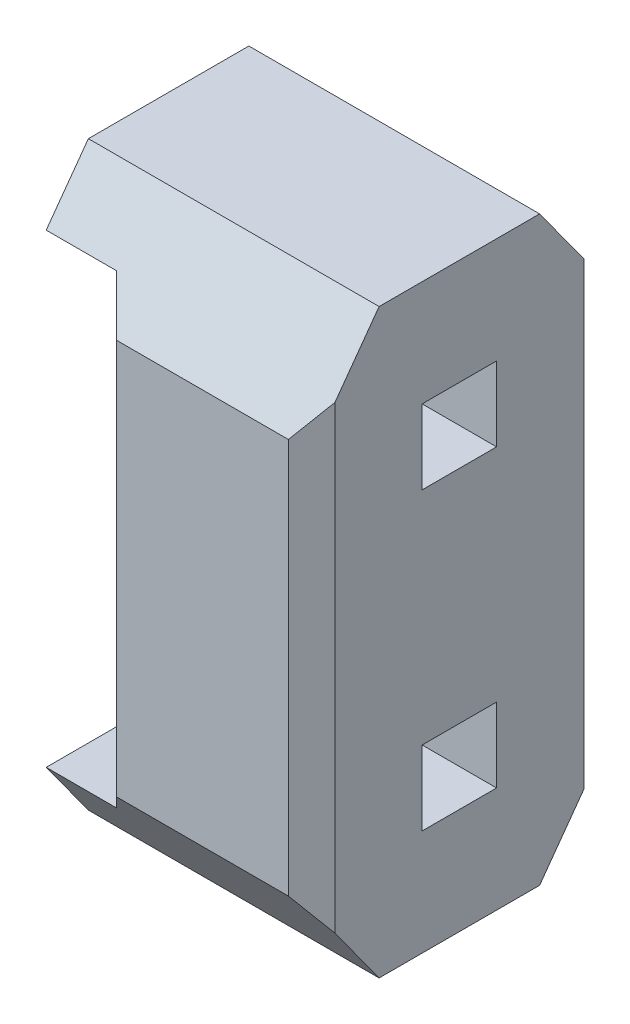
ISO-10303-21;
HEADER;
FILE_DESCRIPTION(('STEP AP214'),'2;1');
FILE_NAME('part.step','',(''),(''),'','','');
FILE_SCHEMA(('AUTOMOTIVE_DESIGN { 1 0 10303 214 1 1 1 1 }'));
ENDSEC;
DATA;
#1=APPLICATION_CONTEXT('core data for automotive mechanical design processes');
#2=APPLICATION_PROTOCOL_DEFINITION('international standard','automotive_design',2000,#1);
#3=PRODUCT_CONTEXT('',#1,'mechanical');
#4=PRODUCT('Part','Part','',(#3));
#5=PRODUCT_RELATED_PRODUCT_CATEGORY('part','',(#4));
#6=PRODUCT_DEFINITION_FORMATION('','',#4);
#7=PRODUCT_DEFINITION_CONTEXT('part definition',#1,'design');
#8=PRODUCT_DEFINITION('design','',#6,#7);
#9=PRODUCT_DEFINITION_SHAPE('','',#8);
#10=(LENGTH_UNIT() NAMED_UNIT(*) SI_UNIT(.MILLI.,.METRE.));
#11=(NAMED_UNIT(*) PLANE_ANGLE_UNIT() SI_UNIT($,.RADIAN.));
#12=(NAMED_UNIT(*) SI_UNIT($,.STERADIAN.) SOLID_ANGLE_UNIT());
#13=UNCERTAINTY_MEASURE_WITH_UNIT(LENGTH_MEASURE(1.E-05),#10,'distance_accuracy_value','');
#14=(GEOMETRIC_REPRESENTATION_CONTEXT(3) GLOBAL_UNCERTAINTY_ASSIGNED_CONTEXT((#13)) GLOBAL_UNIT_ASSIGNED_CONTEXT((#10,
#11,#12)) REPRESENTATION_CONTEXT('',''));
#15=CARTESIAN_POINT('',(0.,0.,0.));
#16=DIRECTION('',(0.,0.,1.));
#17=DIRECTION('',(1.,0.,0.));
#18=AXIS2_PLACEMENT_3D('',#15,#16,#17);
#19=CARTESIAN_POINT('',(1.25,4.6,-25.69));
#20=DIRECTION('',(0.,0.586967571460905,0.809610443394407));
#21=DIRECTION('',(0.,-0.809610443394407,0.586967571460905));
#22=AXIS2_PLACEMENT_3D('',#19,#20,#21);
#23=PLANE('',#22);
#24=DIRECTION('',(1.,0.,0.));
#25=VECTOR('',#24,1.);
#26=CARTESIAN_POINT('',(1.25,4.5,-25.6175));
#27=LINE('',#26,#25);
#28=CARTESIAN_POINT('',(0.,4.5,-25.6175));
#29=VERTEX_POINT('',#28);
#30=CARTESIAN_POINT('',(0.602500000000325,4.5,-25.6175000000001));
#31=VERTEX_POINT('',#30);
#32=EDGE_CURVE('E199',#29,#31,#27,.T.);
#33=ORIENTED_EDGE('',*,*,#32,.T.);
#34=DIRECTION('',(0.506207656348693,-0.698217457033984,0.506207656349605));
#35=VECTOR('',#34,1.);
#36=CARTESIAN_POINT('',(0.6025000000002,4.5,-25.6175));
#37=LINE('',#36,#35);
#38=CARTESIAN_POINT('',(0.819999999999672,4.2,-25.3999999999999));
#39=VERTEX_POINT('',#38);
#40=EDGE_CURVE('E197',#31,#39,#37,.T.);
#41=ORIENTED_EDGE('',*,*,#40,.T.);
#42=DIRECTION('',(1.,0.,0.));
#43=VECTOR('',#42,1.);
#44=CARTESIAN_POINT('',(1.25,4.19999999999999,-25.4));
#45=LINE('',#44,#43);
#46=CARTESIAN_POINT('',(2.30000000000012,4.2,-25.3999999999999));
#47=VERTEX_POINT('',#46);
#48=EDGE_CURVE('E20',#39,#47,#45,.T.);
#49=ORIENTED_EDGE('',*,*,#48,.T.);
#50=DIRECTION('',(0.506207656348955,0.69821745703386,-0.506207656349514));
#51=VECTOR('',#50,1.);
#52=CARTESIAN_POINT('',(2.3,4.19999999999999,-25.4));
#53=LINE('',#52,#51);
#54=CARTESIAN_POINT('',(2.49999999999988,4.47586206896591,-25.6000000000002));
#55=VERTEX_POINT('',#54);
#56=EDGE_CURVE('E181',#47,#55,#53,.T.);
#57=ORIENTED_EDGE('',*,*,#56,.T.);
#58=DIRECTION('',(0.,-0.809610443394407,0.586967571460905));
#59=VECTOR('',#58,1.);
#60=CARTESIAN_POINT('',(2.5,4.6,-25.69));
#61=LINE('',#60,#59);
#62=CARTESIAN_POINT('',(2.5,5.,-25.98));
#63=VERTEX_POINT('',#62);
#64=EDGE_CURVE('E188',#55,#63,#61,.F.);
#65=ORIENTED_EDGE('',*,*,#64,.T.);
#66=DIRECTION('',(1.,0.,0.));
#67=VECTOR('',#66,1.);
#68=CARTESIAN_POINT('',(1.25,5.,-25.98));
#69=LINE('',#68,#67);
#70=CARTESIAN_POINT('',(0.,5.,-25.98));
#71=VERTEX_POINT('',#70);
#72=EDGE_CURVE('E215',#71,#63,#69,.T.);
#73=ORIENTED_EDGE('',*,*,#72,.F.);
#74=DIRECTION('',(0.,-0.809610443394407,0.586967571460905));
#75=VECTOR('',#74,1.);
#76=CARTESIAN_POINT('',(0.,4.6,-25.69));
#77=LINE('',#76,#75);
#78=EDGE_CURVE('E207',#71,#29,#77,.T.);
#79=ORIENTED_EDGE('',*,*,#78,.T.);
#80=EDGE_LOOP('',(#33,#41,#49,#57,#65,#73,#79));
#81=FACE_BOUND('',#80,.T.);
#82=ADVANCED_FACE('F17',(#81),#23,.T.);
#83=CARTESIAN_POINT('',(1.25,4.6,-27.65));
#84=DIRECTION('',(0.,-0.586967571460905,0.809610443394407));
#85=DIRECTION('',(0.,-0.809610443394407,-0.586967571460905));
#86=AXIS2_PLACEMENT_3D('',#83,#84,#85);
#87=PLANE('',#86);
#88=DIRECTION('',(0.,-0.809610443394407,-0.586967571460905));
#89=VECTOR('',#88,1.);
#90=CARTESIAN_POINT('',(0.,4.6,-27.65));
#91=LINE('',#90,#89);
#92=CARTESIAN_POINT('',(0.,5.,-27.36));
#93=VERTEX_POINT('',#92);
#94=CARTESIAN_POINT('',(0.,4.5,-27.7225));
#95=VERTEX_POINT('',#94);
#96=EDGE_CURVE('E263',#93,#95,#91,.T.);
#97=ORIENTED_EDGE('',*,*,#96,.F.);
#98=DIRECTION('',(1.,0.,0.));
#99=VECTOR('',#98,1.);
#100=CARTESIAN_POINT('',(1.25,5.,-27.36));
#101=LINE('',#100,#99);
#102=CARTESIAN_POINT('',(2.5,5.,-27.36));
#103=VERTEX_POINT('',#102);
#104=EDGE_CURVE('E227',#103,#93,#101,.F.);
#105=ORIENTED_EDGE('',*,*,#104,.F.);
#106=DIRECTION('',(0.,-0.809610443394407,-0.586967571460905));
#107=VECTOR('',#106,1.);
#108=CARTESIAN_POINT('',(2.5,4.6,-27.65));
#109=LINE('',#108,#107);
#110=CARTESIAN_POINT('',(2.49999999999988,4.47586206896591,-27.7399999999998));
#111=VERTEX_POINT('',#110);
#112=EDGE_CURVE('E223',#111,#103,#109,.F.);
#113=ORIENTED_EDGE('',*,*,#112,.F.);
#114=DIRECTION('',(0.506207656348954,0.698217457033861,0.506207656349513));
#115=VECTOR('',#114,1.);
#116=CARTESIAN_POINT('',(2.3,4.19999999999999,-27.94));
#117=LINE('',#116,#115);
#118=CARTESIAN_POINT('',(2.30000000000012,4.19999999999999,-27.9400000000001));
#119=VERTEX_POINT('',#118);
#120=EDGE_CURVE('E266',#119,#111,#117,.T.);
#121=ORIENTED_EDGE('',*,*,#120,.F.);
#122=DIRECTION('',(1.,0.,0.));
#123=VECTOR('',#122,1.);
#124=CARTESIAN_POINT('',(1.25,4.19999999999999,-27.94));
#125=LINE('',#124,#123);
#126=CARTESIAN_POINT('',(0.819999999999672,4.19999999999999,-27.9400000000001));
#127=VERTEX_POINT('',#126);
#128=EDGE_CURVE('E205',#127,#119,#125,.T.);
#129=ORIENTED_EDGE('',*,*,#128,.F.);
#130=DIRECTION('',(0.506207656348693,-0.698217457033984,-0.506207656349605));
#131=VECTOR('',#130,1.);
#132=CARTESIAN_POINT('',(0.6025000000002,4.5,-27.7225));
#133=LINE('',#132,#131);
#134=CARTESIAN_POINT('',(0.602500000000325,4.5,-27.7224999999999));
#135=VERTEX_POINT('',#134);
#136=EDGE_CURVE('E203',#135,#127,#133,.T.);
#137=ORIENTED_EDGE('',*,*,#136,.F.);
#138=DIRECTION('',(1.,0.,0.));
#139=VECTOR('',#138,1.);
#140=CARTESIAN_POINT('',(1.25,4.5,-27.7225));
#141=LINE('',#140,#139);
#142=EDGE_CURVE('E261',#95,#135,#141,.T.);
#143=ORIENTED_EDGE('',*,*,#142,.F.);
#144=EDGE_LOOP('',(#97,#105,#113,#121,#129,#137,#143));
#145=FACE_BOUND('',#144,.T.);
#146=ADVANCED_FACE('F285',(#145),#87,.F.);
#147=CARTESIAN_POINT('',(1.25,0.4,-27.65));
#148=DIRECTION('',(0.,0.586967571460905,0.809610443394407));
#149=DIRECTION('',(0.,-0.809610443394407,0.586967571460905));
#150=AXIS2_PLACEMENT_3D('',#147,#148,#149);
#151=PLANE('',#150);
#152=DIRECTION('',(-0.506207656349399,0.698217457033649,-0.506207656349361));
#153=VECTOR('',#152,1.);
#154=CARTESIAN_POINT('',(2.5,0.524137931034496,-27.74));
#155=LINE('',#154,#153);
#156=CARTESIAN_POINT('',(2.49999999999988,0.524137931034498,-27.7399999999999));
#157=VERTEX_POINT('',#156);
#158=CARTESIAN_POINT('',(2.30000000000012,0.800000000000006,-27.9400000000001));
#159=VERTEX_POINT('',#158);
#160=EDGE_CURVE('E251',#157,#159,#155,.T.);
#161=ORIENTED_EDGE('',*,*,#160,.F.);
#162=DIRECTION('',(0.,-0.809610443394407,0.586967571460905));
#163=VECTOR('',#162,1.);
#164=CARTESIAN_POINT('',(2.5,0.4,-27.65));
#165=LINE('',#164,#163);
#166=CARTESIAN_POINT('',(2.5,0.,-27.36));
#167=VERTEX_POINT('',#166);
#168=EDGE_CURVE('E253',#167,#157,#165,.F.);
#169=ORIENTED_EDGE('',*,*,#168,.F.);
#170=DIRECTION('',(1.,0.,0.));
#171=VECTOR('',#170,1.);
#172=CARTESIAN_POINT('',(1.25,0.,-27.36));
#173=LINE('',#172,#171);
#174=CARTESIAN_POINT('',(0.,0.,-27.36));
#175=VERTEX_POINT('',#174);
#176=EDGE_CURVE('E288',#167,#175,#173,.F.);
#177=ORIENTED_EDGE('',*,*,#176,.T.);
#178=DIRECTION('',(0.,-0.809610443394407,0.586967571460905));
#179=VECTOR('',#178,1.);
#180=CARTESIAN_POINT('',(0.,0.4,-27.65));
#181=LINE('',#180,#179);
#182=CARTESIAN_POINT('',(0.,0.500000000000001,-27.7225));
#183=VERTEX_POINT('',#182);
#184=EDGE_CURVE('E255',#183,#175,#181,.T.);
#185=ORIENTED_EDGE('',*,*,#184,.F.);
#186=DIRECTION('',(1.,0.,0.));
#187=VECTOR('',#186,1.);
#188=CARTESIAN_POINT('',(1.25,0.500000000000003,-27.7225));
#189=LINE('',#188,#187);
#190=CARTESIAN_POINT('',(0.602500000000325,0.500000000000002,-27.7224999999999));
#191=VERTEX_POINT('',#190);
#192=EDGE_CURVE('E257',#191,#183,#189,.F.);
#193=ORIENTED_EDGE('',*,*,#192,.F.);
#194=DIRECTION('',(-0.506207656348693,-0.698217457033984,0.506207656349605));
#195=VECTOR('',#194,1.);
#196=CARTESIAN_POINT('',(0.8199999999998,0.800000000000012,-27.94));
#197=LINE('',#196,#195);
#198=CARTESIAN_POINT('',(0.819999999999672,0.800000000000006,-27.9400000000001));
#199=VERTEX_POINT('',#198);
#200=EDGE_CURVE('E259',#199,#191,#197,.T.);
#201=ORIENTED_EDGE('',*,*,#200,.F.);
#202=DIRECTION('',(1.,0.,0.));
#203=VECTOR('',#202,1.);
#204=CARTESIAN_POINT('',(1.25,0.800000000000012,-27.94));
#205=LINE('',#204,#203);
#206=EDGE_CURVE('E249',#159,#199,#205,.F.);
#207=ORIENTED_EDGE('',*,*,#206,.F.);
#208=EDGE_LOOP('',(#161,#169,#177,#185,#193,#201,#207));
#209=FACE_BOUND('',#208,.T.);
#210=ADVANCED_FACE('F431',(#209),#151,.F.);
#211=CARTESIAN_POINT('',(1.25,0.4,-25.69));
#212=DIRECTION('',(0.,-0.586967571460905,0.809610443394407));
#213=DIRECTION('',(0.,-0.809610443394407,-0.586967571460905));
#214=AXIS2_PLACEMENT_3D('',#211,#212,#213);
#215=PLANE('',#214);
#216=DIRECTION('',(1.,0.,0.));
#217=VECTOR('',#216,1.);
#218=CARTESIAN_POINT('',(1.25,0.800000000000011,-25.4));
#219=LINE('',#218,#217);
#220=CARTESIAN_POINT('',(2.30000000000012,0.800000000000005,-25.3999999999999));
#221=VERTEX_POINT('',#220);
#222=CARTESIAN_POINT('',(0.819999999999672,0.800000000000005,-25.3999999999999));
#223=VERTEX_POINT('',#222);
#224=EDGE_CURVE('E191',#221,#223,#219,.F.);
#225=ORIENTED_EDGE('',*,*,#224,.T.);
#226=DIRECTION('',(-0.506207656348693,-0.698217457033984,-0.506207656349605));
#227=VECTOR('',#226,1.);
#228=CARTESIAN_POINT('',(0.8199999999998,0.800000000000011,-25.4));
#229=LINE('',#228,#227);
#230=CARTESIAN_POINT('',(0.602500000000325,0.500000000000001,-25.6175000000001));
#231=VERTEX_POINT('',#230);
#232=EDGE_CURVE('E232',#223,#231,#229,.T.);
#233=ORIENTED_EDGE('',*,*,#232,.T.);
#234=DIRECTION('',(1.,0.,0.));
#235=VECTOR('',#234,1.);
#236=CARTESIAN_POINT('',(1.25,0.500000000000002,-25.6175));
#237=LINE('',#236,#235);
#238=CARTESIAN_POINT('',(0.,0.500000000000001,-25.6175));
#239=VERTEX_POINT('',#238);
#240=EDGE_CURVE('E246',#231,#239,#237,.F.);
#241=ORIENTED_EDGE('',*,*,#240,.T.);
#242=DIRECTION('',(0.,-0.809610443394407,-0.586967571460905));
#243=VECTOR('',#242,1.);
#244=CARTESIAN_POINT('',(0.,0.4,-25.69));
#245=LINE('',#244,#243);
#246=CARTESIAN_POINT('',(0.,0.,-25.98));
#247=VERTEX_POINT('',#246);
#248=EDGE_CURVE('E244',#239,#247,#245,.T.);
#249=ORIENTED_EDGE('',*,*,#248,.T.);
#250=DIRECTION('',(1.,0.,0.));
#251=VECTOR('',#250,1.);
#252=CARTESIAN_POINT('',(1.25,0.,-25.98));
#253=LINE('',#252,#251);
#254=CARTESIAN_POINT('',(2.5,0.,-25.98));
#255=VERTEX_POINT('',#254);
#256=EDGE_CURVE('E293',#247,#255,#253,.T.);
#257=ORIENTED_EDGE('',*,*,#256,.T.);
#258=DIRECTION('',(0.,-0.809610443394407,-0.586967571460905));
#259=VECTOR('',#258,1.);
#260=CARTESIAN_POINT('',(2.5,0.4,-25.69));
#261=LINE('',#260,#259);
#262=CARTESIAN_POINT('',(2.49999999999988,0.524137931034498,-25.6000000000001));
#263=VERTEX_POINT('',#262);
#264=EDGE_CURVE('E241',#255,#263,#261,.F.);
#265=ORIENTED_EDGE('',*,*,#264,.T.);
#266=DIRECTION('',(-0.5062076563494,0.698217457033648,0.506207656349362));
#267=VECTOR('',#266,1.);
#268=CARTESIAN_POINT('',(2.5,0.524137931034496,-25.6));
#269=LINE('',#268,#267);
#270=EDGE_CURVE('E239',#263,#221,#269,.T.);
#271=ORIENTED_EDGE('',*,*,#270,.T.);
#272=EDGE_LOOP('',(#225,#233,#241,#249,#257,#265,#271));
#273=FACE_BOUND('',#272,.T.);
#274=ADVANCED_FACE('F421',(#273),#215,.T.);
#275=CARTESIAN_POINT('',(1.25,5.,-26.67));
#276=DIRECTION('',(0.,1.,0.));
#277=DIRECTION('',(0.,0.,1.));
#278=AXIS2_PLACEMENT_3D('',#275,#276,#277);
#279=PLANE('',#278);
#280=ORIENTED_EDGE('',*,*,#104,.T.);
#281=DIRECTION('',(0.,0.,-1.));
#282=VECTOR('',#281,1.);
#283=CARTESIAN_POINT('',(0.,5.,-26.67));
#284=LINE('',#283,#282);
#285=EDGE_CURVE('E231',#93,#71,#284,.F.);
#286=ORIENTED_EDGE('',*,*,#285,.T.);
#287=ORIENTED_EDGE('',*,*,#72,.T.);
#288=DIRECTION('',(0.,0.,1.));
#289=VECTOR('',#288,1.);
#290=CARTESIAN_POINT('',(2.5,5.,-26.67));
#291=LINE('',#290,#289);
#292=EDGE_CURVE('E219',#63,#103,#291,.F.);
#293=ORIENTED_EDGE('',*,*,#292,.T.);
#294=EDGE_LOOP('',(#280,#286,#287,#293));
#295=FACE_BOUND('',#294,.T.);
#296=ADVANCED_FACE('F229',(#295),#279,.T.);
#297=CARTESIAN_POINT('',(1.25,0.,-26.67));
#298=DIRECTION('',(0.,1.,0.));
#299=DIRECTION('',(0.,0.,1.));
#300=AXIS2_PLACEMENT_3D('',#297,#298,#299);
#301=PLANE('',#300);
#302=DIRECTION('',(0.,0.,-1.));
#303=VECTOR('',#302,1.);
#304=CARTESIAN_POINT('',(0.,0.,-26.67));
#305=LINE('',#304,#303);
#306=EDGE_CURVE('E297',#247,#175,#305,.T.);
#307=ORIENTED_EDGE('',*,*,#306,.T.);
#308=ORIENTED_EDGE('',*,*,#176,.F.);
#309=DIRECTION('',(0.,0.,1.));
#310=VECTOR('',#309,1.);
#311=CARTESIAN_POINT('',(2.5,0.,-26.67));
#312=LINE('',#311,#310);
#313=EDGE_CURVE('E287',#255,#167,#312,.F.);
#314=ORIENTED_EDGE('',*,*,#313,.F.);
#315=ORIENTED_EDGE('',*,*,#256,.F.);
#316=EDGE_LOOP('',(#307,#308,#314,#315));
#317=FACE_BOUND('',#316,.T.);
#318=ADVANCED_FACE('F428',(#317),#301,.F.);
#319=CARTESIAN_POINT('',(0.,4.75,-26.67));
#320=DIRECTION('',(1.,0.,0.));
#321=DIRECTION('',(0.,0.,-1.));
#322=AXIS2_PLACEMENT_3D('',#319,#320,#321);
#323=PLANE('',#322);
#324=ORIENTED_EDGE('',*,*,#285,.F.);
#325=ORIENTED_EDGE('',*,*,#96,.T.);
#326=DIRECTION('',(0.,0.,1.));
#327=VECTOR('',#326,1.);
#328=CARTESIAN_POINT('',(0.,4.5,-26.67));
#329=LINE('',#328,#327);
#330=EDGE_CURVE('E307',#95,#29,#329,.T.);
#331=ORIENTED_EDGE('',*,*,#330,.T.);
#332=ORIENTED_EDGE('',*,*,#78,.F.);
#333=EDGE_LOOP('',(#324,#325,#331,#332));
#334=FACE_BOUND('',#333,.T.);
#335=ADVANCED_FACE('F441',(#334),#323,.F.);
#336=CARTESIAN_POINT('',(0.,0.25,-26.67));
#337=DIRECTION('',(1.,0.,0.));
#338=DIRECTION('',(0.,0.,-1.));
#339=AXIS2_PLACEMENT_3D('',#336,#337,#338);
#340=PLANE('',#339);
#341=ORIENTED_EDGE('',*,*,#306,.F.);
#342=ORIENTED_EDGE('',*,*,#248,.F.);
#343=DIRECTION('',(0.,0.,1.));
#344=VECTOR('',#343,1.);
#345=CARTESIAN_POINT('',(0.,0.5,-26.67));
#346=LINE('',#345,#344);
#347=EDGE_CURVE('E315',#183,#239,#346,.T.);
#348=ORIENTED_EDGE('',*,*,#347,.F.);
#349=ORIENTED_EDGE('',*,*,#184,.T.);
#350=EDGE_LOOP('',(#341,#342,#348,#349));
#351=FACE_BOUND('',#350,.T.);
#352=ADVANCED_FACE('F443',(#351),#340,.F.);
#353=CARTESIAN_POINT('',(1.55,3.45,-26.67));
#354=DIRECTION('',(0.,1.,0.));
#355=DIRECTION('',(0.,0.,1.));
#356=AXIS2_PLACEMENT_3D('',#353,#354,#355);
#357=PLANE('',#356);
#358=DIRECTION('',(1.,0.,0.));
#359=VECTOR('',#358,1.);
#360=CARTESIAN_POINT('',(1.55,3.45,-26.99));
#361=LINE('',#360,#359);
#362=CARTESIAN_POINT('',(0.6,3.45,-26.99));
#363=VERTEX_POINT('',#362);
#364=CARTESIAN_POINT('',(2.5,3.45,-26.99));
#365=VERTEX_POINT('',#364);
#366=EDGE_CURVE('E332',#363,#365,#361,.T.);
#367=ORIENTED_EDGE('',*,*,#366,.F.);
#368=DIRECTION('',(0.,0.,1.));
#369=VECTOR('',#368,1.);
#370=CARTESIAN_POINT('',(0.6,3.45,-26.67));
#371=LINE('',#370,#369);
#372=CARTESIAN_POINT('',(0.6,3.45,-26.35));
#373=VERTEX_POINT('',#372);
#374=EDGE_CURVE('E302',#363,#373,#371,.T.);
#375=ORIENTED_EDGE('',*,*,#374,.T.);
#376=DIRECTION('',(1.,0.,0.));
#377=VECTOR('',#376,1.);
#378=CARTESIAN_POINT('',(1.55,3.45,-26.35));
#379=LINE('',#378,#377);
#380=CARTESIAN_POINT('',(2.5,3.45,-26.35));
#381=VERTEX_POINT('',#380);
#382=EDGE_CURVE('E327',#373,#381,#379,.T.);
#383=ORIENTED_EDGE('',*,*,#382,.T.);
#384=DIRECTION('',(0.,0.,1.));
#385=VECTOR('',#384,1.);
#386=CARTESIAN_POINT('',(2.5,3.45,-26.67));
#387=LINE('',#386,#385);
#388=EDGE_CURVE('E300',#381,#365,#387,.F.);
#389=ORIENTED_EDGE('',*,*,#388,.T.);
#390=EDGE_LOOP('',(#367,#375,#383,#389));
#391=FACE_BOUND('',#390,.T.);
#392=ADVANCED_FACE('F398',(#391),#357,.T.);
#393=CARTESIAN_POINT('',(0.71,2.5,-27.83));
#394=DIRECTION('',(0.707106781190498,0.,0.707106781182598));
#395=DIRECTION('',(0.707106781182598,0.,-0.707106781190498));
#396=AXIS2_PLACEMENT_3D('',#393,#394,#395);
#397=PLANE('',#396);
#398=ORIENTED_EDGE('',*,*,#200,.T.);
#399=DIRECTION('',(0.70710678118618,0.,-0.707106781186916));
#400=VECTOR('',#399,1.);
#401=CARTESIAN_POINT('',(0.6000000000002,0.5,-27.72));
#402=LINE('',#401,#400);
#403=CARTESIAN_POINT('',(0.600000000000407,0.5,-27.7199999999997));
#404=VERTEX_POINT('',#403);
#405=EDGE_CURVE('E312',#404,#191,#402,.T.);
#406=ORIENTED_EDGE('',*,*,#405,.F.);
#407=DIRECTION('',(0.,1.,0.));
#408=VECTOR('',#407,1.);
#409=CARTESIAN_POINT('',(0.6,2.5,-27.72));
#410=LINE('',#409,#408);
#411=CARTESIAN_POINT('',(0.600000000000407,4.5,-27.7199999999997));
#412=VERTEX_POINT('',#411);
#413=EDGE_CURVE('E337',#404,#412,#410,.T.);
#414=ORIENTED_EDGE('',*,*,#413,.T.);
#415=DIRECTION('',(0.70710678118618,0.,-0.707106781186916));
#416=VECTOR('',#415,1.);
#417=CARTESIAN_POINT('',(0.6000000000002,4.5,-27.72));
#418=LINE('',#417,#416);
#419=EDGE_CURVE('E304',#412,#135,#418,.T.);
#420=ORIENTED_EDGE('',*,*,#419,.T.);
#421=ORIENTED_EDGE('',*,*,#136,.T.);
#422=DIRECTION('',(0.,1.,0.));
#423=VECTOR('',#422,1.);
#424=CARTESIAN_POINT('',(0.8199999999998,2.5,-27.94));
#425=LINE('',#424,#423);
#426=EDGE_CURVE('E275',#127,#199,#425,.F.);
#427=ORIENTED_EDGE('',*,*,#426,.T.);
#428=EDGE_LOOP('',(#398,#406,#414,#420,#421,#427));
#429=FACE_BOUND('',#428,.T.);
#430=ADVANCED_FACE('F435',(#429),#397,.F.);
#431=CARTESIAN_POINT('',(0.30125,4.5,-26.67));
#432=DIRECTION('',(0.,1.,0.));
#433=DIRECTION('',(0.,0.,1.));
#434=AXIS2_PLACEMENT_3D('',#431,#432,#433);
#435=PLANE('',#434);
#436=ORIENTED_EDGE('',*,*,#142,.T.);
#437=ORIENTED_EDGE('',*,*,#419,.F.);
#438=DIRECTION('',(0.,0.,-1.));
#439=VECTOR('',#438,1.);
#440=CARTESIAN_POINT('',(0.6,4.5,-26.67));
#441=LINE('',#440,#439);
#442=CARTESIAN_POINT('',(0.600000000000279,4.5,-25.6200000000001));
#443=VERTEX_POINT('',#442);
#444=EDGE_CURVE('E339',#412,#443,#441,.F.);
#445=ORIENTED_EDGE('',*,*,#444,.T.);
#446=DIRECTION('',(-0.707106781182598,0.,-0.707106781190498));
#447=VECTOR('',#446,1.);
#448=CARTESIAN_POINT('',(0.71,4.5,-25.51));
#449=LINE('',#448,#447);
#450=EDGE_CURVE('E310',#443,#31,#449,.F.);
#451=ORIENTED_EDGE('',*,*,#450,.T.);
#452=ORIENTED_EDGE('',*,*,#32,.F.);
#453=ORIENTED_EDGE('',*,*,#330,.F.);
#454=EDGE_LOOP('',(#436,#437,#445,#451,#452,#453));
#455=FACE_BOUND('',#454,.T.);
#456=ADVANCED_FACE('F439',(#455),#435,.F.);
#457=CARTESIAN_POINT('',(0.71,2.5,-25.51));
#458=DIRECTION('',(0.707106781190498,0.,-0.707106781182598));
#459=DIRECTION('',(-0.707106781182598,0.,-0.707106781190498));
#460=AXIS2_PLACEMENT_3D('',#457,#458,#459);
#461=PLANE('',#460);
#462=ORIENTED_EDGE('',*,*,#232,.F.);
#463=DIRECTION('',(0.,1.,0.));
#464=VECTOR('',#463,1.);
#465=CARTESIAN_POINT('',(0.8199999999998,2.5,-25.4));
#466=LINE('',#465,#464);
#467=EDGE_CURVE('E325',#39,#223,#466,.F.);
#468=ORIENTED_EDGE('',*,*,#467,.F.);
#469=ORIENTED_EDGE('',*,*,#40,.F.);
#470=ORIENTED_EDGE('',*,*,#450,.F.);
#471=DIRECTION('',(0.,1.,0.));
#472=VECTOR('',#471,1.);
#473=CARTESIAN_POINT('',(0.6,2.5,-25.62));
#474=LINE('',#473,#472);
#475=CARTESIAN_POINT('',(0.600000000000408,0.5,-25.6200000000003));
#476=VERTEX_POINT('',#475);
#477=EDGE_CURVE('E341',#443,#476,#474,.F.);
#478=ORIENTED_EDGE('',*,*,#477,.T.);
#479=DIRECTION('',(-0.70710678118667,0.,-0.707106781186425));
#480=VECTOR('',#479,1.);
#481=CARTESIAN_POINT('',(0.6025000000002,0.5,-25.6175));
#482=LINE('',#481,#480);
#483=EDGE_CURVE('E318',#231,#476,#482,.T.);
#484=ORIENTED_EDGE('',*,*,#483,.F.);
#485=EDGE_LOOP('',(#462,#468,#469,#470,#478,#484));
#486=FACE_BOUND('',#485,.T.);
#487=ADVANCED_FACE('F416',(#486),#461,.F.);
#488=CARTESIAN_POINT('',(0.30125,0.5,-26.67));
#489=DIRECTION('',(0.,1.,0.));
#490=DIRECTION('',(0.,0.,1.));
#491=AXIS2_PLACEMENT_3D('',#488,#489,#490);
#492=PLANE('',#491);
#493=ORIENTED_EDGE('',*,*,#483,.T.);
#494=DIRECTION('',(0.,0.,-1.));
#495=VECTOR('',#494,1.);
#496=CARTESIAN_POINT('',(0.6,0.5,-26.67));
#497=LINE('',#496,#495);
#498=EDGE_CURVE('E343',#476,#404,#497,.T.);
#499=ORIENTED_EDGE('',*,*,#498,.T.);
#500=ORIENTED_EDGE('',*,*,#405,.T.);
#501=ORIENTED_EDGE('',*,*,#192,.T.);
#502=ORIENTED_EDGE('',*,*,#347,.T.);
#503=ORIENTED_EDGE('',*,*,#240,.F.);
#504=EDGE_LOOP('',(#493,#499,#500,#501,#502,#503));
#505=FACE_BOUND('',#504,.T.);
#506=ADVANCED_FACE('F418',(#505),#492,.T.);
#507=CARTESIAN_POINT('',(1.55,1.23,-26.99));
#508=DIRECTION('',(0.,0.,1.));
#509=DIRECTION('',(1.,0.,0.));
#510=AXIS2_PLACEMENT_3D('',#507,#508,#509);
#511=PLANE('',#510);
#512=DIRECTION('',(1.,0.,0.));
#513=VECTOR('',#512,1.);
#514=CARTESIAN_POINT('',(1.55,1.55,-26.99));
#515=LINE('',#514,#513);
#516=CARTESIAN_POINT('',(2.5,1.55,-26.99));
#517=VERTEX_POINT('',#516);
#518=CARTESIAN_POINT('',(0.6,1.55,-26.99));
#519=VERTEX_POINT('',#518);
#520=EDGE_CURVE('E283',#517,#519,#515,.F.);
#521=ORIENTED_EDGE('',*,*,#520,.T.);
#522=DIRECTION('',(0.,1.,0.));
#523=VECTOR('',#522,1.);
#524=CARTESIAN_POINT('',(0.6,2.5,-26.99));
#525=LINE('',#524,#523);
#526=CARTESIAN_POINT('',(0.6,0.91,-26.99));
#527=VERTEX_POINT('',#526);
#528=EDGE_CURVE('E346',#519,#527,#525,.F.);
#529=ORIENTED_EDGE('',*,*,#528,.T.);
#530=DIRECTION('',(1.,0.,0.));
#531=VECTOR('',#530,1.);
#532=CARTESIAN_POINT('',(1.55,0.91,-26.99));
#533=LINE('',#532,#531);
#534=CARTESIAN_POINT('',(2.5,0.91,-26.99));
#535=VERTEX_POINT('',#534);
#536=EDGE_CURVE('E354',#535,#527,#533,.F.);
#537=ORIENTED_EDGE('',*,*,#536,.F.);
#538=DIRECTION('',(0.,1.,0.));
#539=VECTOR('',#538,1.);
#540=CARTESIAN_POINT('',(2.5,1.23,-26.99));
#541=LINE('',#540,#539);
#542=EDGE_CURVE('E321',#535,#517,#541,.T.);
#543=ORIENTED_EDGE('',*,*,#542,.T.);
#544=EDGE_LOOP('',(#521,#529,#537,#543));
#545=FACE_BOUND('',#544,.T.);
#546=ADVANCED_FACE('F483',(#545),#511,.T.);
#547=CARTESIAN_POINT('',(1.56,2.5,-27.94));
#548=DIRECTION('',(0.,0.,1.));
#549=DIRECTION('',(1.,0.,0.));
#550=AXIS2_PLACEMENT_3D('',#547,#548,#549);
#551=PLANE('',#550);
#552=DIRECTION('',(0.,1.,0.));
#553=VECTOR('',#552,1.);
#554=CARTESIAN_POINT('',(2.30000000000047,2.5,-27.9400000000005));
#555=LINE('',#554,#553);
#556=EDGE_CURVE('E193',#159,#119,#555,.T.);
#557=ORIENTED_EDGE('',*,*,#556,.F.);
#558=ORIENTED_EDGE('',*,*,#206,.T.);
#559=ORIENTED_EDGE('',*,*,#426,.F.);
#560=ORIENTED_EDGE('',*,*,#128,.T.);
#561=EDGE_LOOP('',(#557,#558,#559,#560));
#562=FACE_BOUND('',#561,.T.);
#563=ADVANCED_FACE('F272',(#562),#551,.F.);
#564=CARTESIAN_POINT('',(1.56,2.5,-25.4));
#565=DIRECTION('',(0.,0.,1.));
#566=DIRECTION('',(1.,0.,0.));
#567=AXIS2_PLACEMENT_3D('',#564,#565,#566);
#568=PLANE('',#567);
#569=ORIENTED_EDGE('',*,*,#48,.F.);
#570=ORIENTED_EDGE('',*,*,#467,.T.);
#571=ORIENTED_EDGE('',*,*,#224,.F.);
#572=DIRECTION('',(0.,1.,0.));
#573=VECTOR('',#572,1.);
#574=CARTESIAN_POINT('',(2.30000000000047,2.5,-25.3999999999995));
#575=LINE('',#574,#573);
#576=EDGE_CURVE('E183',#47,#221,#575,.F.);
#577=ORIENTED_EDGE('',*,*,#576,.F.);
#578=EDGE_LOOP('',(#569,#570,#571,#577));
#579=FACE_BOUND('',#578,.T.);
#580=ADVANCED_FACE('F189',(#579),#568,.T.);
#581=CARTESIAN_POINT('',(1.55,3.77,-26.35));
#582=DIRECTION('',(0.,0.,1.));
#583=DIRECTION('',(1.,0.,0.));
#584=AXIS2_PLACEMENT_3D('',#581,#582,#583);
#585=PLANE('',#584);
#586=DIRECTION('',(0.,1.,0.));
#587=VECTOR('',#586,1.);
#588=CARTESIAN_POINT('',(2.5,3.77,-26.35));
#589=LINE('',#588,#587);
#590=CARTESIAN_POINT('',(2.5,4.09,-26.35));
#591=VERTEX_POINT('',#590);
#592=EDGE_CURVE('E330',#381,#591,#589,.T.);
#593=ORIENTED_EDGE('',*,*,#592,.F.);
#594=ORIENTED_EDGE('',*,*,#382,.F.);
#595=DIRECTION('',(0.,1.,0.));
#596=VECTOR('',#595,1.);
#597=CARTESIAN_POINT('',(0.6,2.5,-26.35));
#598=LINE('',#597,#596);
#599=CARTESIAN_POINT('',(0.6,4.09,-26.35));
#600=VERTEX_POINT('',#599);
#601=EDGE_CURVE('E351',#373,#600,#598,.T.);
#602=ORIENTED_EDGE('',*,*,#601,.T.);
#603=DIRECTION('',(1.,0.,0.));
#604=VECTOR('',#603,1.);
#605=CARTESIAN_POINT('',(1.55,4.09,-26.35));
#606=LINE('',#605,#604);
#607=EDGE_CURVE('E368',#600,#591,#606,.T.);
#608=ORIENTED_EDGE('',*,*,#607,.T.);
#609=EDGE_LOOP('',(#593,#594,#602,#608));
#610=FACE_BOUND('',#609,.T.);
#611=ADVANCED_FACE('F402',(#610),#585,.F.);
#612=CARTESIAN_POINT('',(1.55,3.77,-26.99));
#613=DIRECTION('',(0.,0.,1.));
#614=DIRECTION('',(1.,0.,0.));
#615=AXIS2_PLACEMENT_3D('',#612,#613,#614);
#616=PLANE('',#615);
#617=DIRECTION('',(1.,0.,0.));
#618=VECTOR('',#617,1.);
#619=CARTESIAN_POINT('',(1.55,4.09,-26.99));
#620=LINE('',#619,#618);
#621=CARTESIAN_POINT('',(2.5,4.09,-26.99));
#622=VERTEX_POINT('',#621);
#623=CARTESIAN_POINT('',(0.6,4.09,-26.99));
#624=VERTEX_POINT('',#623);
#625=EDGE_CURVE('E371',#622,#624,#620,.F.);
#626=ORIENTED_EDGE('',*,*,#625,.T.);
#627=DIRECTION('',(0.,1.,0.));
#628=VECTOR('',#627,1.);
#629=CARTESIAN_POINT('',(0.6,2.5,-26.99));
#630=LINE('',#629,#628);
#631=EDGE_CURVE('E348',#624,#363,#630,.F.);
#632=ORIENTED_EDGE('',*,*,#631,.T.);
#633=ORIENTED_EDGE('',*,*,#366,.T.);
#634=DIRECTION('',(0.,1.,0.));
#635=VECTOR('',#634,1.);
#636=CARTESIAN_POINT('',(2.5,3.77,-26.99));
#637=LINE('',#636,#635);
#638=EDGE_CURVE('E335',#365,#622,#637,.T.);
#639=ORIENTED_EDGE('',*,*,#638,.T.);
#640=EDGE_LOOP('',(#626,#632,#633,#639));
#641=FACE_BOUND('',#640,.T.);
#642=ADVANCED_FACE('F395',(#641),#616,.T.);
#643=CARTESIAN_POINT('',(0.6,2.5,-26.67));
#644=DIRECTION('',(1.,0.,0.));
#645=DIRECTION('',(0.,0.,-1.));
#646=AXIS2_PLACEMENT_3D('',#643,#644,#645);
#647=PLANE('',#646);
#648=ORIENTED_EDGE('',*,*,#374,.F.);
#649=ORIENTED_EDGE('',*,*,#631,.F.);
#650=DIRECTION('',(0.,0.,1.));
#651=VECTOR('',#650,1.);
#652=CARTESIAN_POINT('',(0.6,4.09,-26.67));
#653=LINE('',#652,#651);
#654=EDGE_CURVE('E192',#624,#600,#653,.T.);
#655=ORIENTED_EDGE('',*,*,#654,.T.);
#656=ORIENTED_EDGE('',*,*,#601,.F.);
#657=EDGE_LOOP('',(#648,#649,#655,#656));
#658=FACE_BOUND('',#657,.T.);
#659=ORIENTED_EDGE('',*,*,#528,.F.);
#660=DIRECTION('',(0.,0.,1.));
#661=VECTOR('',#660,1.);
#662=CARTESIAN_POINT('',(0.6,1.55,-26.67));
#663=LINE('',#662,#661);
#664=CARTESIAN_POINT('',(0.6,1.55,-26.35));
#665=VERTEX_POINT('',#664);
#666=EDGE_CURVE('E360',#519,#665,#663,.T.);
#667=ORIENTED_EDGE('',*,*,#666,.T.);
#668=DIRECTION('',(0.,1.,0.));
#669=VECTOR('',#668,1.);
#670=CARTESIAN_POINT('',(0.6,1.23,-26.35));
#671=LINE('',#670,#669);
#672=CARTESIAN_POINT('',(0.6,0.91,-26.35));
#673=VERTEX_POINT('',#672);
#674=EDGE_CURVE('E374',#665,#673,#671,.F.);
#675=ORIENTED_EDGE('',*,*,#674,.T.);
#676=DIRECTION('',(0.,0.,1.));
#677=VECTOR('',#676,1.);
#678=CARTESIAN_POINT('',(0.6,0.91,-26.67));
#679=LINE('',#678,#677);
#680=EDGE_CURVE('E357',#527,#673,#679,.T.);
#681=ORIENTED_EDGE('',*,*,#680,.F.);
#682=EDGE_LOOP('',(#659,#667,#675,#681));
#683=FACE_BOUND('',#682,.T.);
#684=ORIENTED_EDGE('',*,*,#477,.F.);
#685=ORIENTED_EDGE('',*,*,#444,.F.);
#686=ORIENTED_EDGE('',*,*,#413,.F.);
#687=ORIENTED_EDGE('',*,*,#498,.F.);
#688=EDGE_LOOP('',(#684,#685,#686,#687));
#689=FACE_BOUND('',#688,.T.);
#690=ADVANCED_FACE('F404',(#658,#683,#689),#647,.F.);
#691=CARTESIAN_POINT('',(1.55,0.91,-26.67));
#692=DIRECTION('',(0.,1.,0.));
#693=DIRECTION('',(0.,0.,1.));
#694=AXIS2_PLACEMENT_3D('',#691,#692,#693);
#695=PLANE('',#694);
#696=ORIENTED_EDGE('',*,*,#536,.T.);
#697=ORIENTED_EDGE('',*,*,#680,.T.);
#698=DIRECTION('',(1.,0.,0.));
#699=VECTOR('',#698,1.);
#700=CARTESIAN_POINT('',(1.55,0.91,-26.35));
#701=LINE('',#700,#699);
#702=CARTESIAN_POINT('',(2.5,0.91,-26.35));
#703=VERTEX_POINT('',#702);
#704=EDGE_CURVE('E376',#673,#703,#701,.T.);
#705=ORIENTED_EDGE('',*,*,#704,.T.);
#706=DIRECTION('',(0.,0.,1.));
#707=VECTOR('',#706,1.);
#708=CARTESIAN_POINT('',(2.5,0.91,-26.67));
#709=LINE('',#708,#707);
#710=EDGE_CURVE('E34',#703,#535,#709,.F.);
#711=ORIENTED_EDGE('',*,*,#710,.T.);
#712=EDGE_LOOP('',(#696,#697,#705,#711));
#713=FACE_BOUND('',#712,.T.);
#714=ADVANCED_FACE('F407',(#713),#695,.T.);
#715=CARTESIAN_POINT('',(1.55,1.55,-26.67));
#716=DIRECTION('',(0.,1.,0.));
#717=DIRECTION('',(0.,0.,1.));
#718=AXIS2_PLACEMENT_3D('',#715,#716,#717);
#719=PLANE('',#718);
#720=DIRECTION('',(0.,0.,1.));
#721=VECTOR('',#720,1.);
#722=CARTESIAN_POINT('',(2.5,1.55,-26.67));
#723=LINE('',#722,#721);
#724=CARTESIAN_POINT('',(2.5,1.55,-26.35));
#725=VERTEX_POINT('',#724);
#726=EDGE_CURVE('E362',#725,#517,#723,.F.);
#727=ORIENTED_EDGE('',*,*,#726,.F.);
#728=DIRECTION('',(1.,0.,0.));
#729=VECTOR('',#728,1.);
#730=CARTESIAN_POINT('',(1.55,1.55,-26.35));
#731=LINE('',#730,#729);
#732=EDGE_CURVE('E378',#725,#665,#731,.F.);
#733=ORIENTED_EDGE('',*,*,#732,.T.);
#734=ORIENTED_EDGE('',*,*,#666,.F.);
#735=ORIENTED_EDGE('',*,*,#520,.F.);
#736=EDGE_LOOP('',(#727,#733,#734,#735));
#737=FACE_BOUND('',#736,.T.);
#738=ADVANCED_FACE('F468',(#737),#719,.F.);
#739=CARTESIAN_POINT('',(2.4,2.5,-27.84));
#740=DIRECTION('',(0.707106781189898,0.,-0.707106781183198));
#741=DIRECTION('',(-0.707106781183198,0.,-0.707106781189898));
#742=AXIS2_PLACEMENT_3D('',#739,#740,#741);
#743=PLANE('',#742);
#744=DIRECTION('',(0.,1.,0.));
#745=VECTOR('',#744,1.);
#746=CARTESIAN_POINT('',(2.5,2.5,-27.74));
#747=LINE('',#746,#745);
#748=EDGE_CURVE('E381',#157,#111,#747,.T.);
#749=ORIENTED_EDGE('',*,*,#748,.F.);
#750=ORIENTED_EDGE('',*,*,#160,.T.);
#751=ORIENTED_EDGE('',*,*,#556,.T.);
#752=ORIENTED_EDGE('',*,*,#120,.T.);
#753=EDGE_LOOP('',(#749,#750,#751,#752));
#754=FACE_BOUND('',#753,.T.);
#755=ADVANCED_FACE('F281',(#754),#743,.T.);
#756=CARTESIAN_POINT('',(2.4,2.5,-25.5));
#757=DIRECTION('',(0.707106781189898,0.,0.707106781183198));
#758=DIRECTION('',(0.707106781183198,0.,-0.707106781189898));
#759=AXIS2_PLACEMENT_3D('',#756,#757,#758);
#760=PLANE('',#759);
#761=DIRECTION('',(0.,1.,0.));
#762=VECTOR('',#761,1.);
#763=CARTESIAN_POINT('',(2.5,2.5,-25.6));
#764=LINE('',#763,#762);
#765=EDGE_CURVE('E186',#55,#263,#764,.F.);
#766=ORIENTED_EDGE('',*,*,#765,.F.);
#767=ORIENTED_EDGE('',*,*,#56,.F.);
#768=ORIENTED_EDGE('',*,*,#576,.T.);
#769=ORIENTED_EDGE('',*,*,#270,.F.);
#770=EDGE_LOOP('',(#766,#767,#768,#769));
#771=FACE_BOUND('',#770,.T.);
#772=ADVANCED_FACE('F182',(#771),#760,.T.);
#773=CARTESIAN_POINT('',(1.55,4.09,-26.67));
#774=DIRECTION('',(0.,1.,0.));
#775=DIRECTION('',(0.,0.,1.));
#776=AXIS2_PLACEMENT_3D('',#773,#774,#775);
#777=PLANE('',#776);
#778=DIRECTION('',(0.,0.,-1.));
#779=VECTOR('',#778,1.);
#780=CARTESIAN_POINT('',(2.5,4.09,-26.67));
#781=LINE('',#780,#779);
#782=EDGE_CURVE('E26',#591,#622,#781,.T.);
#783=ORIENTED_EDGE('',*,*,#782,.F.);
#784=ORIENTED_EDGE('',*,*,#607,.F.);
#785=ORIENTED_EDGE('',*,*,#654,.F.);
#786=ORIENTED_EDGE('',*,*,#625,.F.);
#787=EDGE_LOOP('',(#783,#784,#785,#786));
#788=FACE_BOUND('',#787,.T.);
#789=ADVANCED_FACE('F392',(#788),#777,.F.);
#790=CARTESIAN_POINT('',(1.55,1.23,-26.35));
#791=DIRECTION('',(0.,0.,1.));
#792=DIRECTION('',(1.,0.,0.));
#793=AXIS2_PLACEMENT_3D('',#790,#791,#792);
#794=PLANE('',#793);
#795=DIRECTION('',(0.,1.,0.));
#796=VECTOR('',#795,1.);
#797=CARTESIAN_POINT('',(2.5,2.5,-26.35));
#798=LINE('',#797,#796);
#799=EDGE_CURVE('E11',#703,#725,#798,.T.);
#800=ORIENTED_EDGE('',*,*,#799,.F.);
#801=ORIENTED_EDGE('',*,*,#704,.F.);
#802=ORIENTED_EDGE('',*,*,#674,.F.);
#803=ORIENTED_EDGE('',*,*,#732,.F.);
#804=EDGE_LOOP('',(#800,#801,#802,#803));
#805=FACE_BOUND('',#804,.T.);
#806=ADVANCED_FACE('F454',(#805),#794,.F.);
#807=CARTESIAN_POINT('',(2.5,2.5,-26.67));
#808=DIRECTION('',(1.,0.,0.));
#809=DIRECTION('',(0.,0.,-1.));
#810=AXIS2_PLACEMENT_3D('',#807,#808,#809);
#811=PLANE('',#810);
#812=ORIENTED_EDGE('',*,*,#710,.F.);
#813=ORIENTED_EDGE('',*,*,#799,.T.);
#814=ORIENTED_EDGE('',*,*,#726,.T.);
#815=ORIENTED_EDGE('',*,*,#542,.F.);
#816=EDGE_LOOP('',(#812,#813,#814,#815));
#817=FACE_BOUND('',#816,.T.);
#818=ORIENTED_EDGE('',*,*,#592,.T.);
#819=ORIENTED_EDGE('',*,*,#782,.T.);
#820=ORIENTED_EDGE('',*,*,#638,.F.);
#821=ORIENTED_EDGE('',*,*,#388,.F.);
#822=EDGE_LOOP('',(#818,#819,#820,#821));
#823=FACE_BOUND('',#822,.T.);
#824=ORIENTED_EDGE('',*,*,#64,.F.);
#825=ORIENTED_EDGE('',*,*,#765,.T.);
#826=ORIENTED_EDGE('',*,*,#264,.F.);
#827=ORIENTED_EDGE('',*,*,#313,.T.);
#828=ORIENTED_EDGE('',*,*,#168,.T.);
#829=ORIENTED_EDGE('',*,*,#748,.T.);
#830=ORIENTED_EDGE('',*,*,#112,.T.);
#831=ORIENTED_EDGE('',*,*,#292,.F.);
#832=EDGE_LOOP('',(#824,#825,#826,#827,#828,#829,#830,#831));
#833=FACE_BOUND('',#832,.T.);
#834=ADVANCED_FACE('F220',(#817,#823,#833),#811,.T.);
#835=CLOSED_SHELL('',(#82,#146,#210,#274,#296,#318,#335,#352,#392,#430,#456,#487,#506,#546,#563,
#580,#611,#642,#690,#714,#738,#755,#772,#789,#806,#834));
#836=MANIFOLD_SOLID_BREP('B1',#835);
#837=ADVANCED_BREP_SHAPE_REPRESENTATION('',(#18,#836),#14);
#838=SHAPE_DEFINITION_REPRESENTATION(#9,#837);
ENDSEC;
END-ISO-10303-21;
